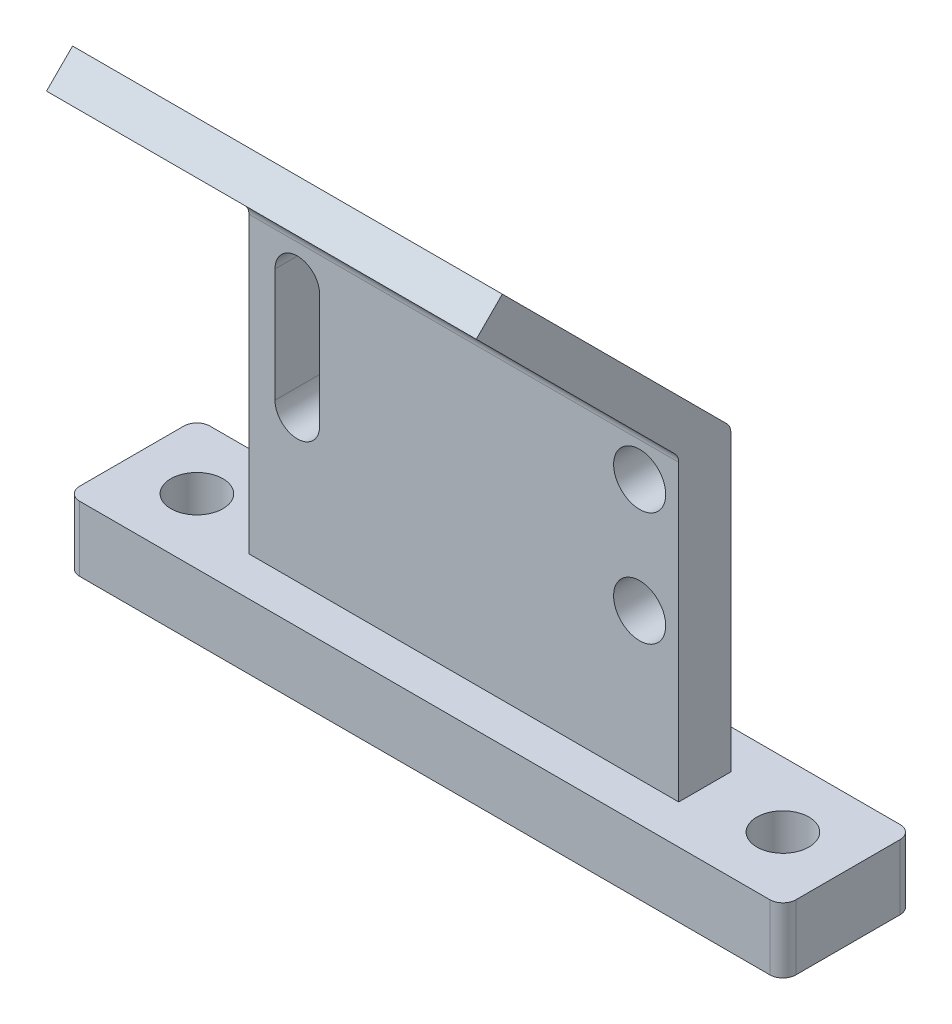
ISO-10303-21;
HEADER;
FILE_DESCRIPTION(('STEP AP214'),'2;1');
FILE_NAME('part.step','',(''),(''),'','','');
FILE_SCHEMA(('AUTOMOTIVE_DESIGN { 1 0 10303 214 1 1 1 1 }'));
ENDSEC;
DATA;
#1=APPLICATION_CONTEXT('core data for automotive mechanical design processes');
#2=APPLICATION_PROTOCOL_DEFINITION('international standard','automotive_design',2000,#1);
#3=PRODUCT_CONTEXT('',#1,'mechanical');
#4=PRODUCT('Part','Part','',(#3));
#5=PRODUCT_RELATED_PRODUCT_CATEGORY('part','',(#4));
#6=PRODUCT_DEFINITION_FORMATION('','',#4);
#7=PRODUCT_DEFINITION_CONTEXT('part definition',#1,'design');
#8=PRODUCT_DEFINITION('design','',#6,#7);
#9=PRODUCT_DEFINITION_SHAPE('','',#8);
#10=(LENGTH_UNIT() NAMED_UNIT(*) SI_UNIT(.MILLI.,.METRE.));
#11=(NAMED_UNIT(*) PLANE_ANGLE_UNIT() SI_UNIT($,.RADIAN.));
#12=(NAMED_UNIT(*) SI_UNIT($,.STERADIAN.) SOLID_ANGLE_UNIT());
#13=UNCERTAINTY_MEASURE_WITH_UNIT(LENGTH_MEASURE(1.E-05),#10,'distance_accuracy_value','');
#14=(GEOMETRIC_REPRESENTATION_CONTEXT(3) GLOBAL_UNCERTAINTY_ASSIGNED_CONTEXT((#13)) GLOBAL_UNIT_ASSIGNED_CONTEXT((#10,
#11,#12)) REPRESENTATION_CONTEXT('',''));
#15=CARTESIAN_POINT('',(0.,0.,0.));
#16=DIRECTION('',(0.,0.,1.));
#17=DIRECTION('',(1.,0.,0.));
#18=AXIS2_PLACEMENT_3D('',#15,#16,#17);
#19=CARTESIAN_POINT('',(16.5338216868942,5.,-2.));
#20=DIRECTION('',(0.,0.,1.));
#21=DIRECTION('',(1.,0.,0.));
#22=AXIS2_PLACEMENT_3D('',#19,#20,#21);
#23=PLANE('',#22);
#24=CARTESIAN_POINT('',(13.5338216868943,16.2195635994835,-2.));
#25=DIRECTION('',(0.,0.,1.));
#26=DIRECTION('',(1.,0.,0.));
#27=AXIS2_PLACEMENT_3D('',#24,#25,#26);
#28=CIRCLE('',#27,2.);
#29=CARTESIAN_POINT('',(15.5338216868943,16.2195635994835,-2.));
#30=VERTEX_POINT('',#29);
#31=EDGE_CURVE('E286',#30,#30,#28,.T.);
#32=ORIENTED_EDGE('',*,*,#31,.T.);
#33=EDGE_LOOP('',(#32));
#34=FACE_BOUND('',#33,.T.);
#35=CARTESIAN_POINT('',(13.5338216868943,24.9520092757703,-2.));
#36=DIRECTION('',(0.,0.,1.));
#37=DIRECTION('',(1.,0.,0.));
#38=AXIS2_PLACEMENT_3D('',#35,#36,#37);
#39=CIRCLE('',#38,2.);
#40=CARTESIAN_POINT('',(15.5338216868943,24.9520092757703,-2.));
#41=VERTEX_POINT('',#40);
#42=EDGE_CURVE('E289',#41,#41,#39,.T.);
#43=ORIENTED_EDGE('',*,*,#42,.T.);
#44=EDGE_LOOP('',(#43));
#45=FACE_BOUND('',#44,.T.);
#46=DIRECTION('',(0.,-1.,0.));
#47=VECTOR('',#46,1.);
#48=CARTESIAN_POINT('',(-11.0340013975966,4.99999999999999,-2.));
#49=LINE('',#48,#47);
#50=CARTESIAN_POINT('',(-11.0340013975966,24.9520092757703,-2.00000000000001));
#51=VERTEX_POINT('',#50);
#52=CARTESIAN_POINT('',(-11.0340013975966,16.2195635994835,-2.00000000000001));
#53=VERTEX_POINT('',#52);
#54=EDGE_CURVE('E54',#51,#53,#49,.T.);
#55=ORIENTED_EDGE('',*,*,#54,.F.);
#56=CARTESIAN_POINT('',(-12.7500898553512,24.9520092757703,-2.));
#57=DIRECTION('',(0.,0.,1.));
#58=DIRECTION('',(1.,0.,0.));
#59=AXIS2_PLACEMENT_3D('',#56,#57,#58);
#60=CIRCLE('',#59,1.71608845775457);
#61=CARTESIAN_POINT('',(-14.4661783131057,24.9520092757703,-2.00000000000001));
#62=VERTEX_POINT('',#61);
#63=EDGE_CURVE('E12',#51,#62,#60,.T.);
#64=ORIENTED_EDGE('',*,*,#63,.T.);
#65=DIRECTION('',(0.,-1.,0.));
#66=VECTOR('',#65,1.);
#67=CARTESIAN_POINT('',(-14.4661783131057,4.99999999999999,-2.));
#68=LINE('',#67,#66);
#69=CARTESIAN_POINT('',(-14.4661783131057,16.2195635994835,-2.));
#70=VERTEX_POINT('',#69);
#71=EDGE_CURVE('E267',#62,#70,#68,.T.);
#72=ORIENTED_EDGE('',*,*,#71,.T.);
#73=CARTESIAN_POINT('',(-12.7500898553512,16.2195635994835,-2.));
#74=DIRECTION('',(0.,0.,1.));
#75=DIRECTION('',(1.,0.,0.));
#76=AXIS2_PLACEMENT_3D('',#73,#74,#75);
#77=CIRCLE('',#76,1.71608845775457);
#78=EDGE_CURVE('E296',#70,#53,#77,.T.);
#79=ORIENTED_EDGE('',*,*,#78,.T.);
#80=EDGE_LOOP('',(#55,#64,#72,#79));
#81=FACE_BOUND('',#80,.T.);
#82=DIRECTION('',(0.,-1.,0.));
#83=VECTOR('',#82,1.);
#84=CARTESIAN_POINT('',(16.5338216868942,28.,-2.));
#85=LINE('',#84,#83);
#86=CARTESIAN_POINT('',(16.5338216868942,27.5857864376269,-2.00000000000003));
#87=VERTEX_POINT('',#86);
#88=CARTESIAN_POINT('',(16.5338216868942,5.,-2.));
#89=VERTEX_POINT('',#88);
#90=EDGE_CURVE('E201',#87,#89,#85,.T.);
#91=ORIENTED_EDGE('',*,*,#90,.T.);
#92=DIRECTION('',(-1.,0.,0.));
#93=VECTOR('',#92,1.);
#94=CARTESIAN_POINT('',(16.5338216868942,5.,-2.));
#95=LINE('',#94,#93);
#96=CARTESIAN_POINT('',(-16.4661783131057,5.,-2.));
#97=VERTEX_POINT('',#96);
#98=EDGE_CURVE('E184',#89,#97,#95,.T.);
#99=ORIENTED_EDGE('',*,*,#98,.T.);
#100=DIRECTION('',(0.,-1.,0.));
#101=VECTOR('',#100,1.);
#102=CARTESIAN_POINT('',(-16.4661783131057,28.,-2.));
#103=LINE('',#102,#101);
#104=CARTESIAN_POINT('',(-16.4661783131057,27.5857864376269,-2.));
#105=VERTEX_POINT('',#104);
#106=EDGE_CURVE('E220',#105,#97,#103,.T.);
#107=ORIENTED_EDGE('',*,*,#106,.F.);
#108=DIRECTION('',(-1.,0.,0.));
#109=VECTOR('',#108,1.);
#110=CARTESIAN_POINT('',(16.9576619371668,27.5857864376269,-2.00000000000003));
#111=LINE('',#110,#109);
#112=EDGE_CURVE('E203',#87,#105,#111,.T.);
#113=ORIENTED_EDGE('',*,*,#112,.F.);
#114=EDGE_LOOP('',(#91,#99,#107,#113));
#115=FACE_BOUND('',#114,.T.);
#116=ADVANCED_FACE('F46',(#34,#45,#81,#115),#23,.F.);
#117=CARTESIAN_POINT('',(-16.4661783131057,28.,2.));
#118=DIRECTION('',(-1.,0.,0.));
#119=DIRECTION('',(0.,0.,1.));
#120=AXIS2_PLACEMENT_3D('',#117,#118,#119);
#121=PLANE('',#120);
#122=CARTESIAN_POINT('',(-16.4661783131057,27.5857864376269,-1.));
#123=DIRECTION('',(-1.,0.,0.));
#124=DIRECTION('',(0.,0.,1.));
#125=AXIS2_PLACEMENT_3D('',#122,#123,#124);
#126=CIRCLE('',#125,1.);
#127=CARTESIAN_POINT('',(-16.4661783131057,28.2928932188135,-1.70710678118654));
#128=VERTEX_POINT('',#127);
#129=EDGE_CURVE('E344',#128,#105,#126,.T.);
#130=ORIENTED_EDGE('',*,*,#129,.T.);
#131=ORIENTED_EDGE('',*,*,#106,.T.);
#132=DIRECTION('',(0.,0.,-1.));
#133=VECTOR('',#132,1.);
#134=CARTESIAN_POINT('',(-16.4661783131057,5.,2.));
#135=LINE('',#134,#133);
#136=CARTESIAN_POINT('',(-16.4661783131057,5.,2.));
#137=VERTEX_POINT('',#136);
#138=EDGE_CURVE('E192',#137,#97,#135,.T.);
#139=ORIENTED_EDGE('',*,*,#138,.F.);
#140=DIRECTION('',(0.,-1.,0.));
#141=VECTOR('',#140,1.);
#142=CARTESIAN_POINT('',(-16.4661783131057,28.,2.));
#143=LINE('',#142,#141);
#144=CARTESIAN_POINT('',(-16.4661783131057,27.5857864376269,2.));
#145=VERTEX_POINT('',#144);
#146=EDGE_CURVE('E223',#145,#137,#143,.T.);
#147=ORIENTED_EDGE('',*,*,#146,.F.);
#148=CARTESIAN_POINT('',(-16.4661783131057,27.5857864376269,3.));
#149=DIRECTION('',(-1.,0.,0.));
#150=DIRECTION('',(0.,0.,1.));
#151=AXIS2_PLACEMENT_3D('',#148,#149,#150);
#152=CIRCLE('',#151,1.);
#153=CARTESIAN_POINT('',(-16.4661783131057,28.2928932188135,2.29289321881345));
#154=VERTEX_POINT('',#153);
#155=EDGE_CURVE('E346',#154,#145,#152,.T.);
#156=ORIENTED_EDGE('',*,*,#155,.F.);
#157=DIRECTION('',(0.,0.707106781186547,0.707106781186548));
#158=VECTOR('',#157,1.);
#159=CARTESIAN_POINT('',(-16.4661783131057,13.,-13.));
#160=LINE('',#159,#158);
#161=CARTESIAN_POINT('',(-16.4661783131057,43.5444825198722,17.5444825198722));
#162=VERTEX_POINT('',#161);
#163=EDGE_CURVE('E348',#154,#162,#160,.T.);
#164=ORIENTED_EDGE('',*,*,#163,.T.);
#165=DIRECTION('',(0.,0.707106781186548,-0.707106781186547));
#166=VECTOR('',#165,1.);
#167=CARTESIAN_POINT('',(-16.4661783131057,30.5444825198721,30.5444825198722));
#168=LINE('',#167,#166);
#169=CARTESIAN_POINT('',(-16.4661783131057,45.5444825198722,15.5444825198722));
#170=VERTEX_POINT('',#169);
#171=EDGE_CURVE('E332',#162,#170,#168,.T.);
#172=ORIENTED_EDGE('',*,*,#171,.T.);
#173=DIRECTION('',(0.,-0.707106781186548,-0.707106781186547));
#174=VECTOR('',#173,1.);
#175=CARTESIAN_POINT('',(-16.4661783131058,15.,-15.));
#176=LINE('',#175,#174);
#177=EDGE_CURVE('E293',#170,#128,#176,.T.);
#178=ORIENTED_EDGE('',*,*,#177,.T.);
#179=EDGE_LOOP('',(#130,#131,#139,#147,#156,#164,#172,#178));
#180=FACE_BOUND('',#179,.T.);
#181=ADVANCED_FACE('F368',(#180),#121,.T.);
#182=CARTESIAN_POINT('',(16.5338216868942,28.,2.));
#183=DIRECTION('',(-1.,0.,0.));
#184=DIRECTION('',(0.,0.,1.));
#185=AXIS2_PLACEMENT_3D('',#182,#183,#184);
#186=PLANE('',#185);
#187=ORIENTED_EDGE('',*,*,#90,.F.);
#188=CARTESIAN_POINT('',(16.5338216868943,27.5857864376269,-1.00000000000003));
#189=DIRECTION('',(-1.,0.,0.));
#190=DIRECTION('',(0.,0.,1.));
#191=AXIS2_PLACEMENT_3D('',#188,#189,#190);
#192=CIRCLE('',#191,1.);
#193=CARTESIAN_POINT('',(16.5338216868943,28.2928932188135,-1.70710678118657));
#194=VERTEX_POINT('',#193);
#195=EDGE_CURVE('E331',#194,#87,#192,.T.);
#196=ORIENTED_EDGE('',*,*,#195,.F.);
#197=DIRECTION('',(0.,-0.707106781186548,-0.707106781186547));
#198=VECTOR('',#197,1.);
#199=CARTESIAN_POINT('',(16.5338216868943,15.,-15.));
#200=LINE('',#199,#198);
#201=CARTESIAN_POINT('',(16.5338216868943,45.5444825198722,15.5444825198722));
#202=VERTEX_POINT('',#201);
#203=EDGE_CURVE('E328',#202,#194,#200,.T.);
#204=ORIENTED_EDGE('',*,*,#203,.F.);
#205=DIRECTION('',(0.,0.707106781186548,-0.707106781186547));
#206=VECTOR('',#205,1.);
#207=CARTESIAN_POINT('',(16.5338216868943,30.5444825198721,30.5444825198722));
#208=LINE('',#207,#206);
#209=CARTESIAN_POINT('',(16.5338216868943,43.5444825198722,17.5444825198722));
#210=VERTEX_POINT('',#209);
#211=EDGE_CURVE('E339',#210,#202,#208,.T.);
#212=ORIENTED_EDGE('',*,*,#211,.F.);
#213=DIRECTION('',(0.,0.707106781186547,0.707106781186548));
#214=VECTOR('',#213,1.);
#215=CARTESIAN_POINT('',(16.5338216868943,13.,-13.));
#216=LINE('',#215,#214);
#217=CARTESIAN_POINT('',(16.5338216868943,28.2928932188135,2.29289321881342));
#218=VERTEX_POINT('',#217);
#219=EDGE_CURVE('E336',#218,#210,#216,.T.);
#220=ORIENTED_EDGE('',*,*,#219,.F.);
#221=CARTESIAN_POINT('',(16.5338216868943,27.5857864376269,2.99999999999997));
#222=DIRECTION('',(-1.,0.,0.));
#223=DIRECTION('',(0.,0.,1.));
#224=AXIS2_PLACEMENT_3D('',#221,#222,#223);
#225=CIRCLE('',#224,1.);
#226=CARTESIAN_POINT('',(16.5338216868943,27.5857864376269,1.99999999999997));
#227=VERTEX_POINT('',#226);
#228=EDGE_CURVE('E334',#218,#227,#225,.T.);
#229=ORIENTED_EDGE('',*,*,#228,.T.);
#230=DIRECTION('',(0.,-1.,0.));
#231=VECTOR('',#230,1.);
#232=CARTESIAN_POINT('',(16.5338216868942,28.,2.));
#233=LINE('',#232,#231);
#234=CARTESIAN_POINT('',(16.5338216868942,5.,2.));
#235=VERTEX_POINT('',#234);
#236=EDGE_CURVE('E206',#227,#235,#233,.T.);
#237=ORIENTED_EDGE('',*,*,#236,.T.);
#238=DIRECTION('',(0.,0.,-1.));
#239=VECTOR('',#238,1.);
#240=CARTESIAN_POINT('',(16.5338216868942,5.,2.));
#241=LINE('',#240,#239);
#242=EDGE_CURVE('E190',#235,#89,#241,.T.);
#243=ORIENTED_EDGE('',*,*,#242,.T.);
#244=EDGE_LOOP('',(#187,#196,#204,#212,#220,#229,#237,#243));
#245=FACE_BOUND('',#244,.T.);
#246=ADVANCED_FACE('F209',(#245),#186,.F.);
#247=CARTESIAN_POINT('',(16.5338216868942,5.,2.));
#248=DIRECTION('',(0.,0.,1.));
#249=DIRECTION('',(1.,0.,0.));
#250=AXIS2_PLACEMENT_3D('',#247,#248,#249);
#251=PLANE('',#250);
#252=DIRECTION('',(-1.,0.,0.));
#253=VECTOR('',#252,1.);
#254=CARTESIAN_POINT('',(16.5338216868942,5.,2.));
#255=LINE('',#254,#253);
#256=EDGE_CURVE('E197',#235,#137,#255,.T.);
#257=ORIENTED_EDGE('',*,*,#256,.F.);
#258=ORIENTED_EDGE('',*,*,#236,.F.);
#259=DIRECTION('',(-1.,0.,0.));
#260=VECTOR('',#259,1.);
#261=CARTESIAN_POINT('',(16.5338216868943,27.5857864376269,1.99999999999997));
#262=LINE('',#261,#260);
#263=EDGE_CURVE('E355',#227,#145,#262,.T.);
#264=ORIENTED_EDGE('',*,*,#263,.T.);
#265=ORIENTED_EDGE('',*,*,#146,.T.);
#266=EDGE_LOOP('',(#257,#258,#264,#265));
#267=FACE_BOUND('',#266,.T.);
#268=CARTESIAN_POINT('',(-12.7500898553512,24.9520092757703,2.));
#269=DIRECTION('',(0.,0.,1.));
#270=DIRECTION('',(1.,0.,0.));
#271=AXIS2_PLACEMENT_3D('',#268,#269,#270);
#272=CIRCLE('',#271,1.71608845775457);
#273=CARTESIAN_POINT('',(-11.0340013975966,24.9520092757703,2.));
#274=VERTEX_POINT('',#273);
#275=CARTESIAN_POINT('',(-14.4661783131057,24.9520092757703,2.));
#276=VERTEX_POINT('',#275);
#277=EDGE_CURVE('E61',#274,#276,#272,.T.);
#278=ORIENTED_EDGE('',*,*,#277,.F.);
#279=DIRECTION('',(0.,-1.,0.));
#280=VECTOR('',#279,1.);
#281=CARTESIAN_POINT('',(-11.0340013975966,24.9520092757703,2.));
#282=LINE('',#281,#280);
#283=CARTESIAN_POINT('',(-11.0340013975966,16.2195635994835,2.));
#284=VERTEX_POINT('',#283);
#285=EDGE_CURVE('E317',#274,#284,#282,.T.);
#286=ORIENTED_EDGE('',*,*,#285,.T.);
#287=CARTESIAN_POINT('',(-12.7500898553512,16.2195635994835,2.));
#288=DIRECTION('',(0.,0.,1.));
#289=DIRECTION('',(1.,0.,0.));
#290=AXIS2_PLACEMENT_3D('',#287,#288,#289);
#291=CIRCLE('',#290,1.71608845775457);
#292=CARTESIAN_POINT('',(-14.4661783131057,16.2195635994835,2.));
#293=VERTEX_POINT('',#292);
#294=EDGE_CURVE('E310',#293,#284,#291,.T.);
#295=ORIENTED_EDGE('',*,*,#294,.F.);
#296=DIRECTION('',(0.,-1.,0.));
#297=VECTOR('',#296,1.);
#298=CARTESIAN_POINT('',(-14.4661783131057,24.9520092757703,2.));
#299=LINE('',#298,#297);
#300=EDGE_CURVE('E397',#276,#293,#299,.T.);
#301=ORIENTED_EDGE('',*,*,#300,.F.);
#302=EDGE_LOOP('',(#278,#286,#295,#301));
#303=FACE_BOUND('',#302,.T.);
#304=CARTESIAN_POINT('',(13.5338216868943,24.9520092757703,2.));
#305=DIRECTION('',(0.,0.,1.));
#306=DIRECTION('',(1.,0.,0.));
#307=AXIS2_PLACEMENT_3D('',#304,#305,#306);
#308=CIRCLE('',#307,2.);
#309=CARTESIAN_POINT('',(15.5338216868943,24.9520092757703,2.));
#310=VERTEX_POINT('',#309);
#311=EDGE_CURVE('E322',#310,#310,#308,.T.);
#312=ORIENTED_EDGE('',*,*,#311,.F.);
#313=EDGE_LOOP('',(#312));
#314=FACE_BOUND('',#313,.T.);
#315=CARTESIAN_POINT('',(13.5338216868943,16.2195635994835,2.));
#316=DIRECTION('',(0.,0.,1.));
#317=DIRECTION('',(1.,0.,0.));
#318=AXIS2_PLACEMENT_3D('',#315,#316,#317);
#319=CIRCLE('',#318,2.);
#320=CARTESIAN_POINT('',(15.5338216868943,16.2195635994835,2.));
#321=VERTEX_POINT('',#320);
#322=EDGE_CURVE('E325',#321,#321,#319,.T.);
#323=ORIENTED_EDGE('',*,*,#322,.F.);
#324=EDGE_LOOP('',(#323));
#325=FACE_BOUND('',#324,.T.);
#326=ADVANCED_FACE('F48',(#267,#303,#314,#325),#251,.T.);
#327=CARTESIAN_POINT('',(26.5338216868942,5.,5.));
#328=DIRECTION('',(0.,0.,1.));
#329=DIRECTION('',(1.,0.,0.));
#330=AXIS2_PLACEMENT_3D('',#327,#328,#329);
#331=PLANE('',#330);
#332=DIRECTION('',(-1.,0.,0.));
#333=VECTOR('',#332,1.);
#334=CARTESIAN_POINT('',(26.5338216868942,0.,5.));
#335=LINE('',#334,#333);
#336=CARTESIAN_POINT('',(26.5338216868942,0.,5.));
#337=VERTEX_POINT('',#336);
#338=CARTESIAN_POINT('',(-26.4661783131057,0.,5.));
#339=VERTEX_POINT('',#338);
#340=EDGE_CURVE('E229',#337,#339,#335,.T.);
#341=ORIENTED_EDGE('',*,*,#340,.F.);
#342=DIRECTION('',(0.,-1.,0.));
#343=VECTOR('',#342,1.);
#344=CARTESIAN_POINT('',(26.5338216868942,5.,5.));
#345=LINE('',#344,#343);
#346=CARTESIAN_POINT('',(26.5338216868942,5.,5.));
#347=VERTEX_POINT('',#346);
#348=EDGE_CURVE('E265',#347,#337,#345,.T.);
#349=ORIENTED_EDGE('',*,*,#348,.F.);
#350=DIRECTION('',(1.,0.,0.));
#351=VECTOR('',#350,1.);
#352=CARTESIAN_POINT('',(-26.4661783131057,5.,5.));
#353=LINE('',#352,#351);
#354=CARTESIAN_POINT('',(-26.4661783131057,5.,5.));
#355=VERTEX_POINT('',#354);
#356=EDGE_CURVE('E226',#355,#347,#353,.T.);
#357=ORIENTED_EDGE('',*,*,#356,.F.);
#358=DIRECTION('',(0.,-1.,0.));
#359=VECTOR('',#358,1.);
#360=CARTESIAN_POINT('',(-26.4661783131057,5.,5.));
#361=LINE('',#360,#359);
#362=EDGE_CURVE('E247',#355,#339,#361,.T.);
#363=ORIENTED_EDGE('',*,*,#362,.T.);
#364=EDGE_LOOP('',(#341,#349,#357,#363));
#365=FACE_BOUND('',#364,.T.);
#366=ADVANCED_FACE('F402',(#365),#331,.T.);
#367=CARTESIAN_POINT('',(26.5338216868942,5.,4.));
#368=DIRECTION('',(0.,-1.,0.));
#369=DIRECTION('',(0.,0.,-1.));
#370=AXIS2_PLACEMENT_3D('',#367,#368,#369);
#371=CYLINDRICAL_SURFACE('',#370,1.);
#372=CARTESIAN_POINT('',(26.5338216868942,0.,4.));
#373=DIRECTION('',(0.,1.,0.));
#374=DIRECTION('',(0.,0.,1.));
#375=AXIS2_PLACEMENT_3D('',#372,#373,#374);
#376=CIRCLE('',#375,1.);
#377=CARTESIAN_POINT('',(27.5338216868943,0.,4.));
#378=VERTEX_POINT('',#377);
#379=EDGE_CURVE('E262',#337,#378,#376,.T.);
#380=ORIENTED_EDGE('',*,*,#379,.T.);
#381=DIRECTION('',(0.,-1.,0.));
#382=VECTOR('',#381,1.);
#383=CARTESIAN_POINT('',(27.5338216868943,5.,4.));
#384=LINE('',#383,#382);
#385=CARTESIAN_POINT('',(27.5338216868943,5.,4.));
#386=VERTEX_POINT('',#385);
#387=EDGE_CURVE('E268',#386,#378,#384,.T.);
#388=ORIENTED_EDGE('',*,*,#387,.F.);
#389=CARTESIAN_POINT('',(26.5338216868942,5.,4.));
#390=DIRECTION('',(0.,1.,0.));
#391=DIRECTION('',(0.,0.,1.));
#392=AXIS2_PLACEMENT_3D('',#389,#390,#391);
#393=CIRCLE('',#392,1.);
#394=EDGE_CURVE('E245',#347,#386,#393,.T.);
#395=ORIENTED_EDGE('',*,*,#394,.F.);
#396=ORIENTED_EDGE('',*,*,#348,.T.);
#397=EDGE_LOOP('',(#380,#388,#395,#396));
#398=FACE_BOUND('',#397,.T.);
#399=ADVANCED_FACE('F451',(#398),#371,.T.);
#400=CARTESIAN_POINT('',(27.5338216868942,5.,4.));
#401=DIRECTION('',(-1.,0.,0.));
#402=DIRECTION('',(0.,0.,1.));
#403=AXIS2_PLACEMENT_3D('',#400,#401,#402);
#404=PLANE('',#403);
#405=DIRECTION('',(0.,0.,-1.));
#406=VECTOR('',#405,1.);
#407=CARTESIAN_POINT('',(27.5338216868942,0.,4.));
#408=LINE('',#407,#406);
#409=CARTESIAN_POINT('',(27.5338216868942,0.,-4.));
#410=VERTEX_POINT('',#409);
#411=EDGE_CURVE('E260',#378,#410,#408,.T.);
#412=ORIENTED_EDGE('',*,*,#411,.T.);
#413=DIRECTION('',(0.,-1.,0.));
#414=VECTOR('',#413,1.);
#415=CARTESIAN_POINT('',(27.5338216868942,5.,-4.));
#416=LINE('',#415,#414);
#417=CARTESIAN_POINT('',(27.5338216868942,5.,-4.));
#418=VERTEX_POINT('',#417);
#419=EDGE_CURVE('E271',#418,#410,#416,.T.);
#420=ORIENTED_EDGE('',*,*,#419,.F.);
#421=DIRECTION('',(0.,0.,-1.));
#422=VECTOR('',#421,1.);
#423=CARTESIAN_POINT('',(27.5338216868942,5.,4.));
#424=LINE('',#423,#422);
#425=EDGE_CURVE('E243',#386,#418,#424,.T.);
#426=ORIENTED_EDGE('',*,*,#425,.F.);
#427=ORIENTED_EDGE('',*,*,#387,.T.);
#428=EDGE_LOOP('',(#412,#420,#426,#427));
#429=FACE_BOUND('',#428,.T.);
#430=ADVANCED_FACE('F455',(#429),#404,.F.);
#431=CARTESIAN_POINT('',(26.5338216868942,5.,-4.));
#432=DIRECTION('',(0.,-1.,0.));
#433=DIRECTION('',(0.,0.,-1.));
#434=AXIS2_PLACEMENT_3D('',#431,#432,#433);
#435=CYLINDRICAL_SURFACE('',#434,0.999999999999998);
#436=CARTESIAN_POINT('',(26.5338216868942,0.,-4.));
#437=DIRECTION('',(0.,1.,0.));
#438=DIRECTION('',(0.,0.,1.));
#439=AXIS2_PLACEMENT_3D('',#436,#437,#438);
#440=CIRCLE('',#439,0.999999999999998);
#441=CARTESIAN_POINT('',(26.5338216868942,0.,-5.));
#442=VERTEX_POINT('',#441);
#443=EDGE_CURVE('E258',#410,#442,#440,.T.);
#444=ORIENTED_EDGE('',*,*,#443,.T.);
#445=DIRECTION('',(0.,-1.,0.));
#446=VECTOR('',#445,1.);
#447=CARTESIAN_POINT('',(26.5338216868942,5.,-5.));
#448=LINE('',#447,#446);
#449=CARTESIAN_POINT('',(26.5338216868942,5.,-5.));
#450=VERTEX_POINT('',#449);
#451=EDGE_CURVE('E274',#450,#442,#448,.T.);
#452=ORIENTED_EDGE('',*,*,#451,.F.);
#453=CARTESIAN_POINT('',(26.5338216868942,5.,-4.));
#454=DIRECTION('',(0.,1.,0.));
#455=DIRECTION('',(0.,0.,1.));
#456=AXIS2_PLACEMENT_3D('',#453,#454,#455);
#457=CIRCLE('',#456,0.999999999999998);
#458=EDGE_CURVE('E240',#418,#450,#457,.T.);
#459=ORIENTED_EDGE('',*,*,#458,.F.);
#460=ORIENTED_EDGE('',*,*,#419,.T.);
#461=EDGE_LOOP('',(#444,#452,#459,#460));
#462=FACE_BOUND('',#461,.T.);
#463=ADVANCED_FACE('F459',(#462),#435,.T.);
#464=CARTESIAN_POINT('',(26.5338216868942,5.,-5.));
#465=DIRECTION('',(0.,0.,1.));
#466=DIRECTION('',(1.,0.,0.));
#467=AXIS2_PLACEMENT_3D('',#464,#465,#466);
#468=PLANE('',#467);
#469=DIRECTION('',(-1.,0.,0.));
#470=VECTOR('',#469,1.);
#471=CARTESIAN_POINT('',(26.5338216868942,0.,-5.));
#472=LINE('',#471,#470);
#473=CARTESIAN_POINT('',(-26.4661783131057,0.,-5.));
#474=VERTEX_POINT('',#473);
#475=EDGE_CURVE('E256',#442,#474,#472,.T.);
#476=ORIENTED_EDGE('',*,*,#475,.T.);
#477=DIRECTION('',(0.,-1.,0.));
#478=VECTOR('',#477,1.);
#479=CARTESIAN_POINT('',(-26.4661783131057,5.,-5.));
#480=LINE('',#479,#478);
#481=CARTESIAN_POINT('',(-26.4661783131057,5.,-5.));
#482=VERTEX_POINT('',#481);
#483=EDGE_CURVE('E277',#482,#474,#480,.T.);
#484=ORIENTED_EDGE('',*,*,#483,.F.);
#485=DIRECTION('',(1.,0.,0.));
#486=VECTOR('',#485,1.);
#487=CARTESIAN_POINT('',(-26.4661783131057,5.,-5.));
#488=LINE('',#487,#486);
#489=EDGE_CURVE('E238',#482,#450,#488,.T.);
#490=ORIENTED_EDGE('',*,*,#489,.T.);
#491=ORIENTED_EDGE('',*,*,#451,.T.);
#492=EDGE_LOOP('',(#476,#484,#490,#491));
#493=FACE_BOUND('',#492,.T.);
#494=ADVANCED_FACE('F463',(#493),#468,.F.);
#495=CARTESIAN_POINT('',(-26.4661783131057,5.,-4.));
#496=DIRECTION('',(0.,-1.,0.));
#497=DIRECTION('',(0.,0.,-1.));
#498=AXIS2_PLACEMENT_3D('',#495,#496,#497);
#499=CYLINDRICAL_SURFACE('',#498,0.999999999999998);
#500=CARTESIAN_POINT('',(-26.4661783131057,0.,-4.));
#501=DIRECTION('',(0.,-1.,0.));
#502=DIRECTION('',(0.,0.,-1.));
#503=AXIS2_PLACEMENT_3D('',#500,#501,#502);
#504=CIRCLE('',#503,0.999999999999998);
#505=CARTESIAN_POINT('',(-27.4661783131057,0.,-4.));
#506=VERTEX_POINT('',#505);
#507=EDGE_CURVE('E253',#506,#474,#504,.T.);
#508=ORIENTED_EDGE('',*,*,#507,.F.);
#509=DIRECTION('',(0.,-1.,0.));
#510=VECTOR('',#509,1.);
#511=CARTESIAN_POINT('',(-27.4661783131057,5.,-4.));
#512=LINE('',#511,#510);
#513=CARTESIAN_POINT('',(-27.4661783131057,5.,-4.));
#514=VERTEX_POINT('',#513);
#515=EDGE_CURVE('E280',#514,#506,#512,.T.);
#516=ORIENTED_EDGE('',*,*,#515,.F.);
#517=CARTESIAN_POINT('',(-26.4661783131057,5.,-4.));
#518=DIRECTION('',(0.,-1.,0.));
#519=DIRECTION('',(0.,0.,-1.));
#520=AXIS2_PLACEMENT_3D('',#517,#518,#519);
#521=CIRCLE('',#520,0.999999999999998);
#522=EDGE_CURVE('E235',#514,#482,#521,.T.);
#523=ORIENTED_EDGE('',*,*,#522,.T.);
#524=ORIENTED_EDGE('',*,*,#483,.T.);
#525=EDGE_LOOP('',(#508,#516,#523,#524));
#526=FACE_BOUND('',#525,.T.);
#527=ADVANCED_FACE('F466',(#526),#499,.T.);
#528=CARTESIAN_POINT('',(-27.4661783131057,5.,4.));
#529=DIRECTION('',(-1.,0.,0.));
#530=DIRECTION('',(0.,0.,1.));
#531=AXIS2_PLACEMENT_3D('',#528,#529,#530);
#532=PLANE('',#531);
#533=DIRECTION('',(0.,0.,-1.));
#534=VECTOR('',#533,1.);
#535=CARTESIAN_POINT('',(-27.4661783131057,0.,4.));
#536=LINE('',#535,#534);
#537=CARTESIAN_POINT('',(-27.4661783131057,0.,4.));
#538=VERTEX_POINT('',#537);
#539=EDGE_CURVE('E250',#538,#506,#536,.T.);
#540=ORIENTED_EDGE('',*,*,#539,.F.);
#541=DIRECTION('',(0.,-1.,0.));
#542=VECTOR('',#541,1.);
#543=CARTESIAN_POINT('',(-27.4661783131057,5.,4.));
#544=LINE('',#543,#542);
#545=CARTESIAN_POINT('',(-27.4661783131057,5.,4.));
#546=VERTEX_POINT('',#545);
#547=EDGE_CURVE('E282',#546,#538,#544,.T.);
#548=ORIENTED_EDGE('',*,*,#547,.F.);
#549=DIRECTION('',(0.,0.,-1.));
#550=VECTOR('',#549,1.);
#551=CARTESIAN_POINT('',(-27.4661783131057,5.,4.));
#552=LINE('',#551,#550);
#553=EDGE_CURVE('E232',#546,#514,#552,.T.);
#554=ORIENTED_EDGE('',*,*,#553,.T.);
#555=ORIENTED_EDGE('',*,*,#515,.T.);
#556=EDGE_LOOP('',(#540,#548,#554,#555));
#557=FACE_BOUND('',#556,.T.);
#558=ADVANCED_FACE('F471',(#557),#532,.T.);
#559=CARTESIAN_POINT('',(-26.4661783131057,5.,4.));
#560=DIRECTION('',(0.,-1.,0.));
#561=DIRECTION('',(0.,0.,-1.));
#562=AXIS2_PLACEMENT_3D('',#559,#560,#561);
#563=CYLINDRICAL_SURFACE('',#562,1.);
#564=CARTESIAN_POINT('',(-26.4661783131057,0.,4.));
#565=DIRECTION('',(0.,-1.,0.));
#566=DIRECTION('',(0.,0.,-1.));
#567=AXIS2_PLACEMENT_3D('',#564,#565,#566);
#568=CIRCLE('',#567,1.);
#569=EDGE_CURVE('E222',#339,#538,#568,.T.);
#570=ORIENTED_EDGE('',*,*,#569,.F.);
#571=ORIENTED_EDGE('',*,*,#362,.F.);
#572=CARTESIAN_POINT('',(-26.4661783131057,5.,4.));
#573=DIRECTION('',(0.,-1.,0.));
#574=DIRECTION('',(0.,0.,-1.));
#575=AXIS2_PLACEMENT_3D('',#572,#573,#574);
#576=CIRCLE('',#575,1.);
#577=EDGE_CURVE('E228',#355,#546,#576,.T.);
#578=ORIENTED_EDGE('',*,*,#577,.T.);
#579=ORIENTED_EDGE('',*,*,#547,.T.);
#580=EDGE_LOOP('',(#570,#571,#578,#579));
#581=FACE_BOUND('',#580,.T.);
#582=ADVANCED_FACE('F445',(#581),#563,.T.);
#583=CARTESIAN_POINT('',(-16.4661783131057,5.,3.));
#584=DIRECTION('',(0.,1.,0.));
#585=DIRECTION('',(0.,0.,1.));
#586=AXIS2_PLACEMENT_3D('',#583,#584,#585);
#587=PLANE('',#586);
#588=ORIENTED_EDGE('',*,*,#242,.F.);
#589=ORIENTED_EDGE('',*,*,#256,.T.);
#590=ORIENTED_EDGE('',*,*,#138,.T.);
#591=ORIENTED_EDGE('',*,*,#98,.F.);
#592=EDGE_LOOP('',(#588,#589,#590,#591));
#593=FACE_BOUND('',#592,.T.);
#594=ORIENTED_EDGE('',*,*,#458,.T.);
#595=ORIENTED_EDGE('',*,*,#489,.F.);
#596=ORIENTED_EDGE('',*,*,#522,.F.);
#597=ORIENTED_EDGE('',*,*,#553,.F.);
#598=ORIENTED_EDGE('',*,*,#577,.F.);
#599=ORIENTED_EDGE('',*,*,#356,.T.);
#600=ORIENTED_EDGE('',*,*,#394,.T.);
#601=ORIENTED_EDGE('',*,*,#425,.T.);
#602=EDGE_LOOP('',(#594,#595,#596,#597,#598,#599,#600,#601));
#603=FACE_BOUND('',#602,.T.);
#604=CARTESIAN_POINT('',(22.5338216868942,5.,0.));
#605=DIRECTION('',(0.,1.,0.));
#606=DIRECTION('',(0.,0.,1.));
#607=AXIS2_PLACEMENT_3D('',#604,#605,#606);
#608=CIRCLE('',#607,2.);
#609=CARTESIAN_POINT('',(22.5338216868942,5.,2.));
#610=VERTEX_POINT('',#609);
#611=EDGE_CURVE('E384',#610,#610,#608,.T.);
#612=ORIENTED_EDGE('',*,*,#611,.F.);
#613=EDGE_LOOP('',(#612));
#614=FACE_BOUND('',#613,.T.);
#615=CARTESIAN_POINT('',(-22.4661783131057,5.,0.));
#616=DIRECTION('',(0.,1.,0.));
#617=DIRECTION('',(0.,0.,1.));
#618=AXIS2_PLACEMENT_3D('',#615,#616,#617);
#619=CIRCLE('',#618,2.);
#620=CARTESIAN_POINT('',(-22.4661783131057,5.,2.));
#621=VERTEX_POINT('',#620);
#622=EDGE_CURVE('E388',#621,#621,#619,.T.);
#623=ORIENTED_EDGE('',*,*,#622,.F.);
#624=EDGE_LOOP('',(#623));
#625=FACE_BOUND('',#624,.T.);
#626=ADVANCED_FACE('F186',(#593,#603,#614,#625),#587,.T.);
#627=CARTESIAN_POINT('',(-16.4661783131057,0.,3.));
#628=DIRECTION('',(0.,1.,0.));
#629=DIRECTION('',(0.,0.,1.));
#630=AXIS2_PLACEMENT_3D('',#627,#628,#629);
#631=PLANE('',#630);
#632=ORIENTED_EDGE('',*,*,#507,.T.);
#633=ORIENTED_EDGE('',*,*,#475,.F.);
#634=ORIENTED_EDGE('',*,*,#443,.F.);
#635=ORIENTED_EDGE('',*,*,#411,.F.);
#636=ORIENTED_EDGE('',*,*,#379,.F.);
#637=ORIENTED_EDGE('',*,*,#340,.T.);
#638=ORIENTED_EDGE('',*,*,#569,.T.);
#639=ORIENTED_EDGE('',*,*,#539,.T.);
#640=EDGE_LOOP('',(#632,#633,#634,#635,#636,#637,#638,#639));
#641=FACE_BOUND('',#640,.T.);
#642=CARTESIAN_POINT('',(22.5338216868942,0.,0.));
#643=DIRECTION('',(0.,1.,0.));
#644=DIRECTION('',(0.,0.,1.));
#645=AXIS2_PLACEMENT_3D('',#642,#643,#644);
#646=CIRCLE('',#645,2.);
#647=CARTESIAN_POINT('',(22.5338216868942,0.,2.));
#648=VERTEX_POINT('',#647);
#649=EDGE_CURVE('E387',#648,#648,#646,.F.);
#650=ORIENTED_EDGE('',*,*,#649,.F.);
#651=EDGE_LOOP('',(#650));
#652=FACE_BOUND('',#651,.T.);
#653=CARTESIAN_POINT('',(-22.4661783131057,0.,0.));
#654=DIRECTION('',(0.,1.,0.));
#655=DIRECTION('',(0.,0.,1.));
#656=AXIS2_PLACEMENT_3D('',#653,#654,#655);
#657=CIRCLE('',#656,2.);
#658=CARTESIAN_POINT('',(-22.4661783131057,0.,2.));
#659=VERTEX_POINT('',#658);
#660=EDGE_CURVE('E196',#659,#659,#657,.F.);
#661=ORIENTED_EDGE('',*,*,#660,.F.);
#662=EDGE_LOOP('',(#661));
#663=FACE_BOUND('',#662,.T.);
#664=ADVANCED_FACE('F438',(#641,#652,#663),#631,.F.);
#665=CARTESIAN_POINT('',(16.5338216868943,15.,-15.));
#666=DIRECTION('',(0.,0.707106781186547,-0.707106781186548));
#667=DIRECTION('',(0.,0.707106781186548,0.707106781186547));
#668=AXIS2_PLACEMENT_3D('',#665,#666,#667);
#669=PLANE('',#668);
#670=ORIENTED_EDGE('',*,*,#177,.F.);
#671=DIRECTION('',(-1.,0.,0.));
#672=VECTOR('',#671,1.);
#673=CARTESIAN_POINT('',(16.5338216868943,45.5444825198722,15.5444825198722));
#674=LINE('',#673,#672);
#675=EDGE_CURVE('E211',#202,#170,#674,.T.);
#676=ORIENTED_EDGE('',*,*,#675,.F.);
#677=ORIENTED_EDGE('',*,*,#203,.T.);
#678=DIRECTION('',(-1.,0.,0.));
#679=VECTOR('',#678,1.);
#680=CARTESIAN_POINT('',(16.5338216868943,28.2928932188135,-1.70710678118657));
#681=LINE('',#680,#679);
#682=EDGE_CURVE('E217',#194,#128,#681,.T.);
#683=ORIENTED_EDGE('',*,*,#682,.T.);
#684=EDGE_LOOP('',(#670,#676,#677,#683));
#685=FACE_BOUND('',#684,.T.);
#686=ADVANCED_FACE('F363',(#685),#669,.T.);
#687=CARTESIAN_POINT('',(16.5338216868943,30.5444825198721,30.5444825198722));
#688=DIRECTION('',(0.,0.707106781186547,0.707106781186548));
#689=DIRECTION('',(0.,-0.707106781186548,0.707106781186547));
#690=AXIS2_PLACEMENT_3D('',#687,#688,#689);
#691=PLANE('',#690);
#692=ORIENTED_EDGE('',*,*,#171,.F.);
#693=DIRECTION('',(-1.,0.,0.));
#694=VECTOR('',#693,1.);
#695=CARTESIAN_POINT('',(16.5338216868943,43.5444825198722,17.5444825198722));
#696=LINE('',#695,#694);
#697=EDGE_CURVE('E214',#210,#162,#696,.T.);
#698=ORIENTED_EDGE('',*,*,#697,.F.);
#699=ORIENTED_EDGE('',*,*,#211,.T.);
#700=ORIENTED_EDGE('',*,*,#675,.T.);
#701=EDGE_LOOP('',(#692,#698,#699,#700));
#702=FACE_BOUND('',#701,.T.);
#703=ADVANCED_FACE('F373',(#702),#691,.T.);
#704=CARTESIAN_POINT('',(16.5338216868943,13.,-13.));
#705=DIRECTION('',(0.,-0.707106781186548,0.707106781186547));
#706=DIRECTION('',(0.,-0.707106781186547,-0.707106781186548));
#707=AXIS2_PLACEMENT_3D('',#704,#705,#706);
#708=PLANE('',#707);
#709=ORIENTED_EDGE('',*,*,#163,.F.);
#710=DIRECTION('',(-1.,0.,0.));
#711=VECTOR('',#710,1.);
#712=CARTESIAN_POINT('',(16.5338216868943,28.2928932188135,2.29289321881342));
#713=LINE('',#712,#711);
#714=EDGE_CURVE('E354',#218,#154,#713,.T.);
#715=ORIENTED_EDGE('',*,*,#714,.F.);
#716=ORIENTED_EDGE('',*,*,#219,.T.);
#717=ORIENTED_EDGE('',*,*,#697,.T.);
#718=EDGE_LOOP('',(#709,#715,#716,#717));
#719=FACE_BOUND('',#718,.T.);
#720=ADVANCED_FACE('F378',(#719),#708,.T.);
#721=CARTESIAN_POINT('',(16.5338216868943,27.5857864376269,2.99999999999997));
#722=DIRECTION('',(-1.,0.,0.));
#723=DIRECTION('',(0.,0.,1.));
#724=AXIS2_PLACEMENT_3D('',#721,#722,#723);
#725=CYLINDRICAL_SURFACE('',#724,1.);
#726=ORIENTED_EDGE('',*,*,#155,.T.);
#727=ORIENTED_EDGE('',*,*,#263,.F.);
#728=ORIENTED_EDGE('',*,*,#228,.F.);
#729=ORIENTED_EDGE('',*,*,#714,.T.);
#730=EDGE_LOOP('',(#726,#727,#728,#729));
#731=FACE_BOUND('',#730,.T.);
#732=ADVANCED_FACE('F380',(#731),#725,.F.);
#733=CARTESIAN_POINT('',(16.5338216868943,27.5857864376269,-1.00000000000003));
#734=DIRECTION('',(-1.,0.,0.));
#735=DIRECTION('',(0.,0.,1.));
#736=AXIS2_PLACEMENT_3D('',#733,#734,#735);
#737=CYLINDRICAL_SURFACE('',#736,1.);
#738=ORIENTED_EDGE('',*,*,#129,.F.);
#739=ORIENTED_EDGE('',*,*,#682,.F.);
#740=ORIENTED_EDGE('',*,*,#195,.T.);
#741=ORIENTED_EDGE('',*,*,#112,.T.);
#742=EDGE_LOOP('',(#738,#739,#740,#741));
#743=FACE_BOUND('',#742,.T.);
#744=ADVANCED_FACE('F366',(#743),#737,.T.);
#745=CARTESIAN_POINT('',(13.5338216868943,16.2195635994835,-12.));
#746=DIRECTION('',(0.,0.,1.));
#747=DIRECTION('',(1.,0.,0.));
#748=AXIS2_PLACEMENT_3D('',#745,#746,#747);
#749=CYLINDRICAL_SURFACE('',#748,2.);
#750=ORIENTED_EDGE('',*,*,#322,.T.);
#751=EDGE_LOOP('',(#750));
#752=FACE_BOUND('',#751,.T.);
#753=ORIENTED_EDGE('',*,*,#31,.F.);
#754=EDGE_LOOP('',(#753));
#755=FACE_BOUND('',#754,.T.);
#756=ADVANCED_FACE('F407',(#752,#755),#749,.F.);
#757=CARTESIAN_POINT('',(13.5338216868943,24.9520092757703,-12.));
#758=DIRECTION('',(0.,0.,1.));
#759=DIRECTION('',(1.,0.,0.));
#760=AXIS2_PLACEMENT_3D('',#757,#758,#759);
#761=CYLINDRICAL_SURFACE('',#760,2.);
#762=ORIENTED_EDGE('',*,*,#311,.T.);
#763=EDGE_LOOP('',(#762));
#764=FACE_BOUND('',#763,.T.);
#765=ORIENTED_EDGE('',*,*,#42,.F.);
#766=EDGE_LOOP('',(#765));
#767=FACE_BOUND('',#766,.T.);
#768=ADVANCED_FACE('F410',(#764,#767),#761,.F.);
#769=CARTESIAN_POINT('',(-12.7500898553512,24.9520092757703,-12.));
#770=DIRECTION('',(0.,0.,1.));
#771=DIRECTION('',(1.,0.,0.));
#772=AXIS2_PLACEMENT_3D('',#769,#770,#771);
#773=CYLINDRICAL_SURFACE('',#772,1.71608845775457);
#774=DIRECTION('',(0.,0.,1.));
#775=VECTOR('',#774,1.);
#776=CARTESIAN_POINT('',(-11.0340013975966,24.9520092757703,-12.));
#777=LINE('',#776,#775);
#778=EDGE_CURVE('E290',#51,#274,#777,.T.);
#779=ORIENTED_EDGE('',*,*,#778,.T.);
#780=ORIENTED_EDGE('',*,*,#277,.T.);
#781=DIRECTION('',(0.,0.,1.));
#782=VECTOR('',#781,1.);
#783=CARTESIAN_POINT('',(-14.4661783131057,24.9520092757703,-12.));
#784=LINE('',#783,#782);
#785=EDGE_CURVE('E314',#62,#276,#784,.T.);
#786=ORIENTED_EDGE('',*,*,#785,.F.);
#787=ORIENTED_EDGE('',*,*,#63,.F.);
#788=EDGE_LOOP('',(#779,#780,#786,#787));
#789=FACE_BOUND('',#788,.T.);
#790=ADVANCED_FACE('F316',(#789),#773,.F.);
#791=CARTESIAN_POINT('',(-11.0340013975966,24.9520092757703,-12.));
#792=DIRECTION('',(-1.,0.,0.));
#793=DIRECTION('',(0.,-1.,0.));
#794=AXIS2_PLACEMENT_3D('',#791,#792,#793);
#795=PLANE('',#794);
#796=ORIENTED_EDGE('',*,*,#54,.T.);
#797=DIRECTION('',(0.,0.,1.));
#798=VECTOR('',#797,1.);
#799=CARTESIAN_POINT('',(-11.0340013975966,16.2195635994835,-12.));
#800=LINE('',#799,#798);
#801=EDGE_CURVE('E304',#53,#284,#800,.T.);
#802=ORIENTED_EDGE('',*,*,#801,.T.);
#803=ORIENTED_EDGE('',*,*,#285,.F.);
#804=ORIENTED_EDGE('',*,*,#778,.F.);
#805=EDGE_LOOP('',(#796,#802,#803,#804));
#806=FACE_BOUND('',#805,.T.);
#807=ADVANCED_FACE('F302',(#806),#795,.T.);
#808=CARTESIAN_POINT('',(-12.7500898553512,16.2195635994835,-12.));
#809=DIRECTION('',(0.,0.,1.));
#810=DIRECTION('',(1.,0.,0.));
#811=AXIS2_PLACEMENT_3D('',#808,#809,#810);
#812=CYLINDRICAL_SURFACE('',#811,1.71608845775457);
#813=DIRECTION('',(0.,0.,1.));
#814=VECTOR('',#813,1.);
#815=CARTESIAN_POINT('',(-14.4661783131057,16.2195635994835,-12.));
#816=LINE('',#815,#814);
#817=EDGE_CURVE('E69',#70,#293,#816,.T.);
#818=ORIENTED_EDGE('',*,*,#817,.T.);
#819=ORIENTED_EDGE('',*,*,#294,.T.);
#820=ORIENTED_EDGE('',*,*,#801,.F.);
#821=ORIENTED_EDGE('',*,*,#78,.F.);
#822=EDGE_LOOP('',(#818,#819,#820,#821));
#823=FACE_BOUND('',#822,.T.);
#824=ADVANCED_FACE('F308',(#823),#812,.F.);
#825=CARTESIAN_POINT('',(-14.4661783131057,24.9520092757703,-12.));
#826=DIRECTION('',(-1.,0.,0.));
#827=DIRECTION('',(0.,-1.,0.));
#828=AXIS2_PLACEMENT_3D('',#825,#826,#827);
#829=PLANE('',#828);
#830=ORIENTED_EDGE('',*,*,#785,.T.);
#831=ORIENTED_EDGE('',*,*,#300,.T.);
#832=ORIENTED_EDGE('',*,*,#817,.F.);
#833=ORIENTED_EDGE('',*,*,#71,.F.);
#834=EDGE_LOOP('',(#830,#831,#832,#833));
#835=FACE_BOUND('',#834,.T.);
#836=ADVANCED_FACE('F313',(#835),#829,.F.);
#837=CARTESIAN_POINT('',(-22.4661783131057,-5.65685424949239,0.));
#838=DIRECTION('',(0.,1.,0.));
#839=DIRECTION('',(0.,0.,1.));
#840=AXIS2_PLACEMENT_3D('',#837,#838,#839);
#841=CYLINDRICAL_SURFACE('',#840,2.);
#842=ORIENTED_EDGE('',*,*,#660,.T.);
#843=EDGE_LOOP('',(#842));
#844=FACE_BOUND('',#843,.T.);
#845=ORIENTED_EDGE('',*,*,#622,.T.);
#846=EDGE_LOOP('',(#845));
#847=FACE_BOUND('',#846,.T.);
#848=ADVANCED_FACE('F505',(#844,#847),#841,.F.);
#849=CARTESIAN_POINT('',(22.5338216868942,-5.65685424949239,0.));
#850=DIRECTION('',(0.,1.,0.));
#851=DIRECTION('',(0.,0.,1.));
#852=AXIS2_PLACEMENT_3D('',#849,#850,#851);
#853=CYLINDRICAL_SURFACE('',#852,2.);
#854=ORIENTED_EDGE('',*,*,#649,.T.);
#855=EDGE_LOOP('',(#854));
#856=FACE_BOUND('',#855,.T.);
#857=ORIENTED_EDGE('',*,*,#611,.T.);
#858=EDGE_LOOP('',(#857));
#859=FACE_BOUND('',#858,.T.);
#860=ADVANCED_FACE('F507',(#856,#859),#853,.F.);
#861=CLOSED_SHELL('',(#116,#181,#246,#326,#366,#399,#430,#463,#494,#527,#558,#582,#626,#664,
#686,#703,#720,#732,#744,#756,#768,#790,#807,#824,#836,#848,#860));
#862=MANIFOLD_SOLID_BREP('B2',#861);
#863=ADVANCED_BREP_SHAPE_REPRESENTATION('',(#18,#862),#14);
#864=SHAPE_DEFINITION_REPRESENTATION(#9,#863);
ENDSEC;
END-ISO-10303-21;
